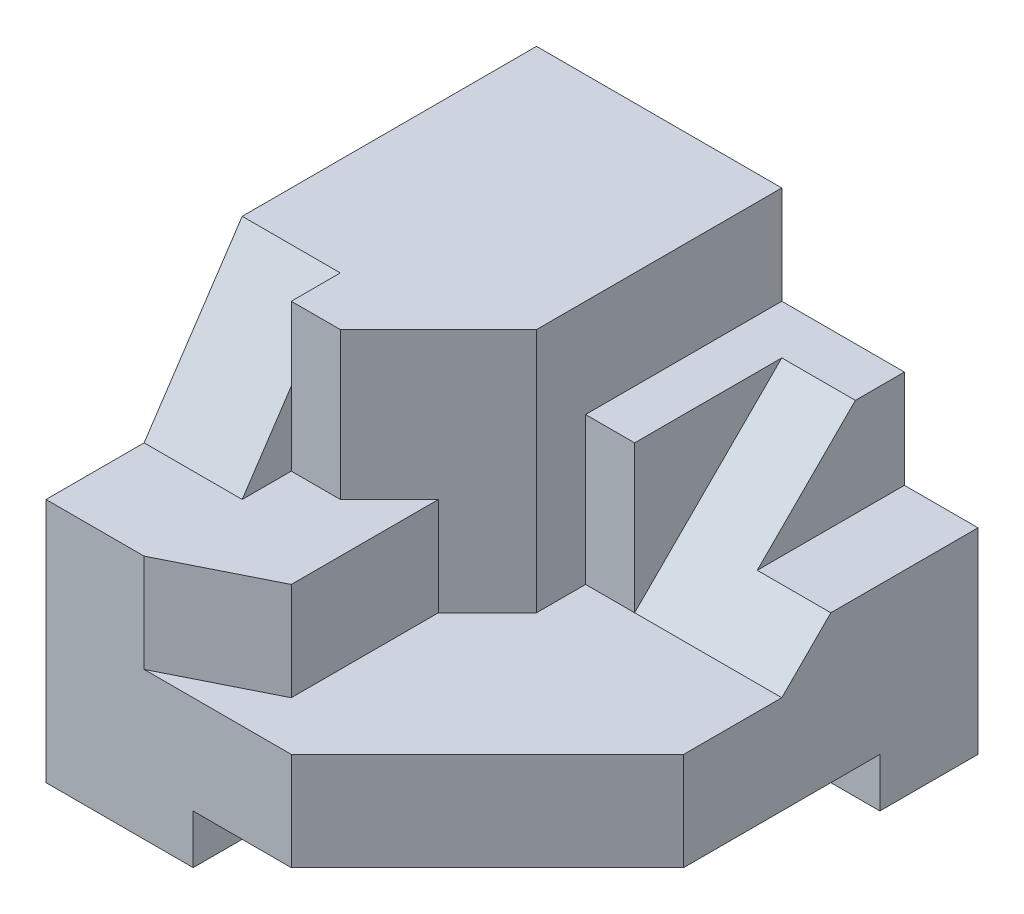
ISO-10303-21;
HEADER;
FILE_DESCRIPTION(('STEP AP214'),'2;1');
FILE_NAME('part.step','',(''),(''),'','','');
FILE_SCHEMA(('AUTOMOTIVE_DESIGN { 1 0 10303 214 1 1 1 1 }'));
ENDSEC;
DATA;
#1=APPLICATION_CONTEXT('core data for automotive mechanical design processes');
#2=APPLICATION_PROTOCOL_DEFINITION('international standard','automotive_design',2000,#1);
#3=PRODUCT_CONTEXT('',#1,'mechanical');
#4=PRODUCT('Part','Part','',(#3));
#5=PRODUCT_RELATED_PRODUCT_CATEGORY('part','',(#4));
#6=PRODUCT_DEFINITION_FORMATION('','',#4);
#7=PRODUCT_DEFINITION_CONTEXT('part definition',#1,'design');
#8=PRODUCT_DEFINITION('design','',#6,#7);
#9=PRODUCT_DEFINITION_SHAPE('','',#8);
#10=(LENGTH_UNIT() NAMED_UNIT(*) SI_UNIT(.MILLI.,.METRE.));
#11=(NAMED_UNIT(*) PLANE_ANGLE_UNIT() SI_UNIT($,.RADIAN.));
#12=(NAMED_UNIT(*) SI_UNIT($,.STERADIAN.) SOLID_ANGLE_UNIT());
#13=UNCERTAINTY_MEASURE_WITH_UNIT(LENGTH_MEASURE(1.E-05),#10,'distance_accuracy_value','');
#14=(GEOMETRIC_REPRESENTATION_CONTEXT(3) GLOBAL_UNCERTAINTY_ASSIGNED_CONTEXT((#13)) GLOBAL_UNIT_ASSIGNED_CONTEXT((#10,
#11,#12)) REPRESENTATION_CONTEXT('',''));
#15=CARTESIAN_POINT('',(0.,0.,0.));
#16=DIRECTION('',(0.,0.,1.));
#17=DIRECTION('',(1.,0.,0.));
#18=AXIS2_PLACEMENT_3D('',#15,#16,#17);
#19=CARTESIAN_POINT('',(-0.500000000000002,-0.999999999999998,9.));
#20=DIRECTION('',(-0.447213595499958,0.,-0.894427190999916));
#21=DIRECTION('',(-0.894427190999916,0.,0.447213595499958));
#22=AXIS2_PLACEMENT_3D('',#19,#20,#21);
#23=PLANE('',#22);
#24=DIRECTION('',(0.894427190999916,0.,-0.447213595499958));
#25=VECTOR('',#24,1.);
#26=CARTESIAN_POINT('',(-2.5,1.,10.));
#27=LINE('',#26,#25);
#28=CARTESIAN_POINT('',(-2.5,1.,10.));
#29=VERTEX_POINT('',#28);
#30=CARTESIAN_POINT('',(-0.500000000000002,1.,9.));
#31=VERTEX_POINT('',#30);
#32=EDGE_CURVE('E209',#29,#31,#27,.T.);
#33=ORIENTED_EDGE('',*,*,#32,.F.);
#34=DIRECTION('',(0.,1.,0.));
#35=VECTOR('',#34,1.);
#36=CARTESIAN_POINT('',(-2.5,-0.999999999999998,10.));
#37=LINE('',#36,#35);
#38=CARTESIAN_POINT('',(-2.5,-0.999999999999998,10.));
#39=VERTEX_POINT('',#38);
#40=EDGE_CURVE('E273',#39,#29,#37,.T.);
#41=ORIENTED_EDGE('',*,*,#40,.F.);
#42=DIRECTION('',(-0.894427190999916,0.,0.447213595499958));
#43=VECTOR('',#42,1.);
#44=CARTESIAN_POINT('',(-0.500000000000002,-0.999999999999998,9.));
#45=LINE('',#44,#43);
#46=CARTESIAN_POINT('',(-0.500000000000002,-0.999999999999998,9.));
#47=VERTEX_POINT('',#46);
#48=EDGE_CURVE('E262',#47,#39,#45,.T.);
#49=ORIENTED_EDGE('',*,*,#48,.F.);
#50=DIRECTION('',(0.,1.,0.));
#51=VECTOR('',#50,1.);
#52=CARTESIAN_POINT('',(-0.500000000000002,-0.999999999999998,9.));
#53=LINE('',#52,#51);
#54=EDGE_CURVE('E277',#47,#31,#53,.T.);
#55=ORIENTED_EDGE('',*,*,#54,.T.);
#56=EDGE_LOOP('',(#33,#41,#49,#55));
#57=FACE_BOUND('',#56,.T.);
#58=ADVANCED_FACE('F33',(#57),#23,.F.);
#59=CARTESIAN_POINT('',(-0.500000000000002,-0.999999999999998,9.));
#60=DIRECTION('',(-1.,0.,0.));
#61=DIRECTION('',(0.,0.,1.));
#62=AXIS2_PLACEMENT_3D('',#59,#60,#61);
#63=PLANE('',#62);
#64=DIRECTION('',(0.,0.,-1.));
#65=VECTOR('',#64,1.);
#66=CARTESIAN_POINT('',(-0.500000000000002,1.,9.));
#67=LINE('',#66,#65);
#68=CARTESIAN_POINT('',(-0.500000000000001,1.,6.));
#69=VERTEX_POINT('',#68);
#70=EDGE_CURVE('E196',#31,#69,#67,.T.);
#71=ORIENTED_EDGE('',*,*,#70,.F.);
#72=ORIENTED_EDGE('',*,*,#54,.F.);
#73=DIRECTION('',(0.,0.,1.));
#74=VECTOR('',#73,1.);
#75=CARTESIAN_POINT('',(-0.500000000000002,-0.999999999999998,9.));
#76=LINE('',#75,#74);
#77=CARTESIAN_POINT('',(-0.500000000000002,-0.999999999999998,6.));
#78=VERTEX_POINT('',#77);
#79=EDGE_CURVE('E259',#78,#47,#76,.T.);
#80=ORIENTED_EDGE('',*,*,#79,.F.);
#81=DIRECTION('',(0.,1.,0.));
#82=VECTOR('',#81,1.);
#83=CARTESIAN_POINT('',(-0.500000000000002,-0.999999999999998,6.));
#84=LINE('',#83,#82);
#85=EDGE_CURVE('E280',#78,#69,#84,.T.);
#86=ORIENTED_EDGE('',*,*,#85,.T.);
#87=EDGE_LOOP('',(#71,#72,#80,#86));
#88=FACE_BOUND('',#87,.T.);
#89=ADVANCED_FACE('F437',(#88),#63,.F.);
#90=CARTESIAN_POINT('',(4.5,-4.,10.));
#91=DIRECTION('',(-1.,0.,0.));
#92=DIRECTION('',(0.,0.,1.));
#93=AXIS2_PLACEMENT_3D('',#90,#91,#92);
#94=PLANE('',#93);
#95=DIRECTION('',(0.,0.707106781186547,-0.707106781186548));
#96=VECTOR('',#95,1.);
#97=CARTESIAN_POINT('',(4.5,0.,3.));
#98=LINE('',#97,#96);
#99=CARTESIAN_POINT('',(4.5,-0.999999999999998,4.));
#100=VERTEX_POINT('',#99);
#101=CARTESIAN_POINT('',(4.5,0.,3.));
#102=VERTEX_POINT('',#101);
#103=EDGE_CURVE('E324',#100,#102,#98,.T.);
#104=ORIENTED_EDGE('',*,*,#103,.F.);
#105=DIRECTION('',(0.,0.,-1.));
#106=VECTOR('',#105,1.);
#107=CARTESIAN_POINT('',(4.5,-0.999999999999998,4.));
#108=LINE('',#107,#106);
#109=CARTESIAN_POINT('',(4.5,-0.999999999999998,6.));
#110=VERTEX_POINT('',#109);
#111=EDGE_CURVE('E267',#110,#100,#108,.T.);
#112=ORIENTED_EDGE('',*,*,#111,.F.);
#113=DIRECTION('',(0.,-1.,0.));
#114=VECTOR('',#113,1.);
#115=CARTESIAN_POINT('',(4.5,4.,6.));
#116=LINE('',#115,#114);
#117=CARTESIAN_POINT('',(4.5,-3.,6.));
#118=VERTEX_POINT('',#117);
#119=EDGE_CURVE('E287',#110,#118,#116,.T.);
#120=ORIENTED_EDGE('',*,*,#119,.T.);
#121=DIRECTION('',(0.,0.,1.));
#122=VECTOR('',#121,1.);
#123=CARTESIAN_POINT('',(4.5,-3.,10.));
#124=LINE('',#123,#122);
#125=CARTESIAN_POINT('',(4.5,-3.,2.));
#126=VERTEX_POINT('',#125);
#127=EDGE_CURVE('E291',#126,#118,#124,.T.);
#128=ORIENTED_EDGE('',*,*,#127,.F.);
#129=DIRECTION('',(0.,-1.,0.));
#130=VECTOR('',#129,1.);
#131=CARTESIAN_POINT('',(4.5,-3.,2.));
#132=LINE('',#131,#130);
#133=CARTESIAN_POINT('',(4.5,-4.,2.));
#134=VERTEX_POINT('',#133);
#135=EDGE_CURVE('E307',#126,#134,#132,.T.);
#136=ORIENTED_EDGE('',*,*,#135,.T.);
#137=DIRECTION('',(0.,0.,-1.));
#138=VECTOR('',#137,1.);
#139=CARTESIAN_POINT('',(4.5,-4.,10.));
#140=LINE('',#139,#138);
#141=CARTESIAN_POINT('',(4.5,-4.,0.));
#142=VERTEX_POINT('',#141);
#143=EDGE_CURVE('E363',#134,#142,#140,.T.);
#144=ORIENTED_EDGE('',*,*,#143,.T.);
#145=DIRECTION('',(0.,1.,0.));
#146=VECTOR('',#145,1.);
#147=CARTESIAN_POINT('',(4.5,-4.,0.));
#148=LINE('',#147,#146);
#149=CARTESIAN_POINT('',(4.5,0.,0.));
#150=VERTEX_POINT('',#149);
#151=EDGE_CURVE('E357',#142,#150,#148,.T.);
#152=ORIENTED_EDGE('',*,*,#151,.T.);
#153=DIRECTION('',(0.,0.,-1.));
#154=VECTOR('',#153,1.);
#155=CARTESIAN_POINT('',(4.5,0.,0.));
#156=LINE('',#155,#154);
#157=EDGE_CURVE('E330',#102,#150,#156,.T.);
#158=ORIENTED_EDGE('',*,*,#157,.F.);
#159=EDGE_LOOP('',(#104,#112,#120,#128,#136,#144,#152,#158));
#160=FACE_BOUND('',#159,.T.);
#161=ADVANCED_FACE('F404',(#160),#94,.F.);
#162=CARTESIAN_POINT('',(4.5,4.,10.));
#163=DIRECTION('',(0.,-1.,0.));
#164=DIRECTION('',(0.,0.,-1.));
#165=AXIS2_PLACEMENT_3D('',#162,#163,#164);
#166=PLANE('',#165);
#167=DIRECTION('',(0.,0.,-1.));
#168=VECTOR('',#167,1.);
#169=CARTESIAN_POINT('',(-2.5,4.,10.));
#170=LINE('',#169,#168);
#171=CARTESIAN_POINT('',(-2.5,4.,7.));
#172=VERTEX_POINT('',#171);
#173=CARTESIAN_POINT('',(-2.5,4.,6.));
#174=VERTEX_POINT('',#173);
#175=EDGE_CURVE('E223',#172,#174,#170,.T.);
#176=ORIENTED_EDGE('',*,*,#175,.F.);
#177=DIRECTION('',(-1.,0.,0.));
#178=VECTOR('',#177,1.);
#179=CARTESIAN_POINT('',(-1.5,4.,7.));
#180=LINE('',#179,#178);
#181=CARTESIAN_POINT('',(-1.5,4.,7.));
#182=VERTEX_POINT('',#181);
#183=EDGE_CURVE('E199',#182,#172,#180,.T.);
#184=ORIENTED_EDGE('',*,*,#183,.F.);
#185=DIRECTION('',(-0.707106781186549,0.,0.707106781186547));
#186=VECTOR('',#185,1.);
#187=CARTESIAN_POINT('',(-0.500000000000002,4.,6.));
#188=LINE('',#187,#186);
#189=CARTESIAN_POINT('',(0.5,4.,5.));
#190=VERTEX_POINT('',#189);
#191=EDGE_CURVE('E205',#190,#182,#188,.T.);
#192=ORIENTED_EDGE('',*,*,#191,.F.);
#193=DIRECTION('',(0.,0.,1.));
#194=VECTOR('',#193,1.);
#195=CARTESIAN_POINT('',(0.5,4.,5.));
#196=LINE('',#195,#194);
#197=CARTESIAN_POINT('',(0.5,4.,0.));
#198=VERTEX_POINT('',#197);
#199=EDGE_CURVE('E250',#198,#190,#196,.T.);
#200=ORIENTED_EDGE('',*,*,#199,.F.);
#201=DIRECTION('',(-1.,0.,0.));
#202=VECTOR('',#201,1.);
#203=CARTESIAN_POINT('',(4.5,4.,0.));
#204=LINE('',#203,#202);
#205=CARTESIAN_POINT('',(-4.5,4.,0.));
#206=VERTEX_POINT('',#205);
#207=EDGE_CURVE('E348',#198,#206,#204,.T.);
#208=ORIENTED_EDGE('',*,*,#207,.T.);
#209=DIRECTION('',(0.,0.,-1.));
#210=VECTOR('',#209,1.);
#211=CARTESIAN_POINT('',(-4.5,4.,10.));
#212=LINE('',#211,#210);
#213=CARTESIAN_POINT('',(-4.5,4.,6.));
#214=VERTEX_POINT('',#213);
#215=EDGE_CURVE('E351',#214,#206,#212,.T.);
#216=ORIENTED_EDGE('',*,*,#215,.F.);
#217=DIRECTION('',(-1.,0.,0.));
#218=VECTOR('',#217,1.);
#219=CARTESIAN_POINT('',(-2.5,4.,6.));
#220=LINE('',#219,#218);
#221=EDGE_CURVE('E230',#174,#214,#220,.T.);
#222=ORIENTED_EDGE('',*,*,#221,.F.);
#223=EDGE_LOOP('',(#176,#184,#192,#200,#208,#216,#222));
#224=FACE_BOUND('',#223,.T.);
#225=ADVANCED_FACE('F421',(#224),#166,.F.);
#226=CARTESIAN_POINT('',(0.,0.,10.));
#227=DIRECTION('',(0.,0.,1.));
#228=DIRECTION('',(1.,0.,0.));
#229=AXIS2_PLACEMENT_3D('',#226,#227,#228);
#230=PLANE('',#229);
#231=DIRECTION('',(-1.,0.,0.));
#232=VECTOR('',#231,1.);
#233=CARTESIAN_POINT('',(-2.5,1.,10.));
#234=LINE('',#233,#232);
#235=CARTESIAN_POINT('',(-4.5,1.,10.));
#236=VERTEX_POINT('',#235);
#237=EDGE_CURVE('E234',#29,#236,#234,.T.);
#238=ORIENTED_EDGE('',*,*,#237,.T.);
#239=DIRECTION('',(0.,-1.,0.));
#240=VECTOR('',#239,1.);
#241=CARTESIAN_POINT('',(-4.5,-4.,10.));
#242=LINE('',#241,#240);
#243=CARTESIAN_POINT('',(-4.5,-4.,10.));
#244=VERTEX_POINT('',#243);
#245=EDGE_CURVE('E345',#236,#244,#242,.T.);
#246=ORIENTED_EDGE('',*,*,#245,.T.);
#247=DIRECTION('',(1.,0.,0.));
#248=VECTOR('',#247,1.);
#249=CARTESIAN_POINT('',(4.5,-4.,10.));
#250=LINE('',#249,#248);
#251=CARTESIAN_POINT('',(-1.5,-4.,10.));
#252=VERTEX_POINT('',#251);
#253=EDGE_CURVE('E347',#244,#252,#250,.T.);
#254=ORIENTED_EDGE('',*,*,#253,.T.);
#255=DIRECTION('',(0.,-1.,0.));
#256=VECTOR('',#255,1.);
#257=CARTESIAN_POINT('',(-1.5,-3.,10.));
#258=LINE('',#257,#256);
#259=CARTESIAN_POINT('',(-1.5,-3.,10.));
#260=VERTEX_POINT('',#259);
#261=EDGE_CURVE('E303',#260,#252,#258,.T.);
#262=ORIENTED_EDGE('',*,*,#261,.F.);
#263=DIRECTION('',(-1.,0.,0.));
#264=VECTOR('',#263,1.);
#265=CARTESIAN_POINT('',(-1.5,-3.,10.));
#266=LINE('',#265,#264);
#267=CARTESIAN_POINT('',(0.499999999999998,-3.,10.));
#268=VERTEX_POINT('',#267);
#269=EDGE_CURVE('E294',#268,#260,#266,.T.);
#270=ORIENTED_EDGE('',*,*,#269,.F.);
#271=DIRECTION('',(0.,-1.,0.));
#272=VECTOR('',#271,1.);
#273=CARTESIAN_POINT('',(0.499999999999998,4.,10.));
#274=LINE('',#273,#272);
#275=CARTESIAN_POINT('',(0.499999999999999,-0.999999999999998,10.));
#276=VERTEX_POINT('',#275);
#277=EDGE_CURVE('E55',#276,#268,#274,.T.);
#278=ORIENTED_EDGE('',*,*,#277,.F.);
#279=DIRECTION('',(1.,0.,0.));
#280=VECTOR('',#279,1.);
#281=CARTESIAN_POINT('',(-2.5,-0.999999999999998,10.));
#282=LINE('',#281,#280);
#283=EDGE_CURVE('E48',#39,#276,#282,.T.);
#284=ORIENTED_EDGE('',*,*,#283,.F.);
#285=ORIENTED_EDGE('',*,*,#40,.T.);
#286=EDGE_LOOP('',(#238,#246,#254,#262,#270,#278,#284,#285));
#287=FACE_BOUND('',#286,.T.);
#288=ADVANCED_FACE('F456',(#287),#230,.T.);
#289=CARTESIAN_POINT('',(0.,-3.,0.));
#290=DIRECTION('',(0.,1.,0.));
#291=DIRECTION('',(-1.,0.,0.));
#292=AXIS2_PLACEMENT_3D('',#289,#290,#291);
#293=PLANE('',#292);
#294=DIRECTION('',(-0.707106781186547,0.,0.707106781186548));
#295=VECTOR('',#294,1.);
#296=CARTESIAN_POINT('',(5.25,-3.,5.25));
#297=LINE('',#296,#295);
#298=EDGE_CURVE('E276',#118,#268,#297,.T.);
#299=ORIENTED_EDGE('',*,*,#298,.T.);
#300=ORIENTED_EDGE('',*,*,#269,.T.);
#301=DIRECTION('',(0.,0.,-1.));
#302=VECTOR('',#301,1.);
#303=CARTESIAN_POINT('',(-1.5,-3.,2.));
#304=LINE('',#303,#302);
#305=CARTESIAN_POINT('',(-1.5,-3.,2.));
#306=VERTEX_POINT('',#305);
#307=EDGE_CURVE('E297',#260,#306,#304,.T.);
#308=ORIENTED_EDGE('',*,*,#307,.T.);
#309=DIRECTION('',(1.,0.,0.));
#310=VECTOR('',#309,1.);
#311=CARTESIAN_POINT('',(4.5,-3.,2.));
#312=LINE('',#311,#310);
#313=EDGE_CURVE('E300',#306,#126,#312,.T.);
#314=ORIENTED_EDGE('',*,*,#313,.T.);
#315=ORIENTED_EDGE('',*,*,#127,.T.);
#316=EDGE_LOOP('',(#299,#300,#308,#314,#315));
#317=FACE_BOUND('',#316,.T.);
#318=ADVANCED_FACE('F453',(#317),#293,.F.);
#319=CARTESIAN_POINT('',(-4.5,-4.,10.));
#320=DIRECTION('',(1.,0.,0.));
#321=DIRECTION('',(0.,0.,-1.));
#322=AXIS2_PLACEMENT_3D('',#319,#320,#321);
#323=PLANE('',#322);
#324=ORIENTED_EDGE('',*,*,#245,.F.);
#325=DIRECTION('',(0.,0.,1.));
#326=VECTOR('',#325,1.);
#327=CARTESIAN_POINT('',(-4.5,1.,8.));
#328=LINE('',#327,#326);
#329=CARTESIAN_POINT('',(-4.5,1.,8.));
#330=VERTEX_POINT('',#329);
#331=EDGE_CURVE('E226',#330,#236,#328,.T.);
#332=ORIENTED_EDGE('',*,*,#331,.F.);
#333=DIRECTION('',(0.,-0.832050294337844,0.554700196225229));
#334=VECTOR('',#333,1.);
#335=CARTESIAN_POINT('',(-4.5,4.,6.));
#336=LINE('',#335,#334);
#337=EDGE_CURVE('E222',#214,#330,#336,.T.);
#338=ORIENTED_EDGE('',*,*,#337,.F.);
#339=ORIENTED_EDGE('',*,*,#215,.T.);
#340=DIRECTION('',(0.,-1.,0.));
#341=VECTOR('',#340,1.);
#342=CARTESIAN_POINT('',(-4.5,-4.,0.));
#343=LINE('',#342,#341);
#344=CARTESIAN_POINT('',(-4.5,-4.,0.));
#345=VERTEX_POINT('',#344);
#346=EDGE_CURVE('E340',#206,#345,#343,.T.);
#347=ORIENTED_EDGE('',*,*,#346,.T.);
#348=DIRECTION('',(0.,0.,-1.));
#349=VECTOR('',#348,1.);
#350=CARTESIAN_POINT('',(-4.5,-4.,10.));
#351=LINE('',#350,#349);
#352=EDGE_CURVE('E365',#244,#345,#351,.T.);
#353=ORIENTED_EDGE('',*,*,#352,.F.);
#354=EDGE_LOOP('',(#324,#332,#338,#339,#347,#353));
#355=FACE_BOUND('',#354,.T.);
#356=ADVANCED_FACE('F35',(#355),#323,.F.);
#357=CARTESIAN_POINT('',(4.5,-4.,10.));
#358=DIRECTION('',(0.,1.,0.));
#359=DIRECTION('',(-1.,0.,0.));
#360=AXIS2_PLACEMENT_3D('',#357,#358,#359);
#361=PLANE('',#360);
#362=ORIENTED_EDGE('',*,*,#143,.F.);
#363=DIRECTION('',(1.,0.,0.));
#364=VECTOR('',#363,1.);
#365=CARTESIAN_POINT('',(4.5,-4.,2.));
#366=LINE('',#365,#364);
#367=CARTESIAN_POINT('',(-1.5,-4.,2.));
#368=VERTEX_POINT('',#367);
#369=EDGE_CURVE('E295',#368,#134,#366,.T.);
#370=ORIENTED_EDGE('',*,*,#369,.F.);
#371=DIRECTION('',(0.,0.,-1.));
#372=VECTOR('',#371,1.);
#373=CARTESIAN_POINT('',(-1.5,-4.,2.));
#374=LINE('',#373,#372);
#375=EDGE_CURVE('E289',#252,#368,#374,.T.);
#376=ORIENTED_EDGE('',*,*,#375,.F.);
#377=ORIENTED_EDGE('',*,*,#253,.F.);
#378=ORIENTED_EDGE('',*,*,#352,.T.);
#379=DIRECTION('',(1.,0.,0.));
#380=VECTOR('',#379,1.);
#381=CARTESIAN_POINT('',(4.5,-4.,0.));
#382=LINE('',#381,#380);
#383=EDGE_CURVE('E354',#345,#142,#382,.T.);
#384=ORIENTED_EDGE('',*,*,#383,.T.);
#385=EDGE_LOOP('',(#362,#370,#376,#377,#378,#384));
#386=FACE_BOUND('',#385,.T.);
#387=ADVANCED_FACE('F411',(#386),#361,.F.);
#388=CARTESIAN_POINT('',(0.,0.,0.));
#389=DIRECTION('',(0.,0.,1.));
#390=DIRECTION('',(1.,0.,0.));
#391=AXIS2_PLACEMENT_3D('',#388,#389,#390);
#392=PLANE('',#391);
#393=DIRECTION('',(0.,1.,0.));
#394=VECTOR('',#393,1.);
#395=CARTESIAN_POINT('',(0.5,4.,0.));
#396=LINE('',#395,#394);
#397=CARTESIAN_POINT('',(0.5,2.,0.));
#398=VERTEX_POINT('',#397);
#399=EDGE_CURVE('E244',#398,#198,#396,.T.);
#400=ORIENTED_EDGE('',*,*,#399,.F.);
#401=DIRECTION('',(1.,0.,0.));
#402=VECTOR('',#401,1.);
#403=CARTESIAN_POINT('',(1.5,2.,0.));
#404=LINE('',#403,#402);
#405=CARTESIAN_POINT('',(3.,2.,0.));
#406=VERTEX_POINT('',#405);
#407=EDGE_CURVE('E321',#398,#406,#404,.T.);
#408=ORIENTED_EDGE('',*,*,#407,.T.);
#409=DIRECTION('',(0.,1.,0.));
#410=VECTOR('',#409,1.);
#411=CARTESIAN_POINT('',(3.,4.,0.));
#412=LINE('',#411,#410);
#413=CARTESIAN_POINT('',(3.,0.,0.));
#414=VERTEX_POINT('',#413);
#415=EDGE_CURVE('E329',#414,#406,#412,.T.);
#416=ORIENTED_EDGE('',*,*,#415,.F.);
#417=DIRECTION('',(1.,0.,0.));
#418=VECTOR('',#417,1.);
#419=CARTESIAN_POINT('',(3.,0.,0.));
#420=LINE('',#419,#418);
#421=EDGE_CURVE('E337',#414,#150,#420,.T.);
#422=ORIENTED_EDGE('',*,*,#421,.T.);
#423=ORIENTED_EDGE('',*,*,#151,.F.);
#424=ORIENTED_EDGE('',*,*,#383,.F.);
#425=ORIENTED_EDGE('',*,*,#346,.F.);
#426=ORIENTED_EDGE('',*,*,#207,.F.);
#427=EDGE_LOOP('',(#400,#408,#416,#422,#423,#424,#425,#426));
#428=FACE_BOUND('',#427,.T.);
#429=ADVANCED_FACE('F384',(#428),#392,.F.);
#430=CARTESIAN_POINT('',(3.,0.,0.));
#431=DIRECTION('',(0.,-1.,0.));
#432=DIRECTION('',(0.,0.,-1.));
#433=AXIS2_PLACEMENT_3D('',#430,#431,#432);
#434=PLANE('',#433);
#435=ORIENTED_EDGE('',*,*,#157,.T.);
#436=ORIENTED_EDGE('',*,*,#421,.F.);
#437=DIRECTION('',(0.,0.,-1.));
#438=VECTOR('',#437,1.);
#439=CARTESIAN_POINT('',(3.,0.,0.));
#440=LINE('',#439,#438);
#441=CARTESIAN_POINT('',(3.,0.,3.));
#442=VERTEX_POINT('',#441);
#443=EDGE_CURVE('E327',#442,#414,#440,.T.);
#444=ORIENTED_EDGE('',*,*,#443,.F.);
#445=DIRECTION('',(1.,0.,0.));
#446=VECTOR('',#445,1.);
#447=CARTESIAN_POINT('',(3.,0.,3.));
#448=LINE('',#447,#446);
#449=EDGE_CURVE('E341',#442,#102,#448,.T.);
#450=ORIENTED_EDGE('',*,*,#449,.T.);
#451=EDGE_LOOP('',(#435,#436,#444,#450));
#452=FACE_BOUND('',#451,.T.);
#453=ADVANCED_FACE('F379',(#452),#434,.F.);
#454=CARTESIAN_POINT('',(3.,0.,3.));
#455=DIRECTION('',(0.,-0.707106781186548,-0.707106781186547));
#456=DIRECTION('',(0.,0.707106781186547,-0.707106781186548));
#457=AXIS2_PLACEMENT_3D('',#454,#455,#456);
#458=PLANE('',#457);
#459=ORIENTED_EDGE('',*,*,#103,.T.);
#460=ORIENTED_EDGE('',*,*,#449,.F.);
#461=DIRECTION('',(0.,-0.707106781186548,0.707106781186547));
#462=VECTOR('',#461,1.);
#463=CARTESIAN_POINT('',(3.,1.5,1.5));
#464=LINE('',#463,#462);
#465=CARTESIAN_POINT('',(3.,2.,1.));
#466=VERTEX_POINT('',#465);
#467=EDGE_CURVE('E41',#466,#442,#464,.T.);
#468=ORIENTED_EDGE('',*,*,#467,.F.);
#469=DIRECTION('',(1.,0.,0.));
#470=VECTOR('',#469,1.);
#471=CARTESIAN_POINT('',(1.5,2.,1.));
#472=LINE('',#471,#470);
#473=CARTESIAN_POINT('',(1.5,2.,1.));
#474=VERTEX_POINT('',#473);
#475=EDGE_CURVE('E319',#474,#466,#472,.T.);
#476=ORIENTED_EDGE('',*,*,#475,.F.);
#477=DIRECTION('',(0.,0.707106781186548,-0.707106781186547));
#478=VECTOR('',#477,1.);
#479=CARTESIAN_POINT('',(1.5,2.,1.));
#480=LINE('',#479,#478);
#481=CARTESIAN_POINT('',(1.5,-0.999999999999998,4.));
#482=VERTEX_POINT('',#481);
#483=EDGE_CURVE('E316',#482,#474,#480,.T.);
#484=ORIENTED_EDGE('',*,*,#483,.F.);
#485=DIRECTION('',(1.,0.,0.));
#486=VECTOR('',#485,1.);
#487=CARTESIAN_POINT('',(3.,-0.999999999999998,4.));
#488=LINE('',#487,#486);
#489=EDGE_CURVE('E333',#482,#100,#488,.T.);
#490=ORIENTED_EDGE('',*,*,#489,.T.);
#491=EDGE_LOOP('',(#459,#460,#468,#476,#484,#490));
#492=FACE_BOUND('',#491,.T.);
#493=ADVANCED_FACE('F375',(#492),#458,.F.);
#494=CARTESIAN_POINT('',(3.,0.,0.));
#495=DIRECTION('',(-1.,0.,0.));
#496=DIRECTION('',(0.,0.,1.));
#497=AXIS2_PLACEMENT_3D('',#494,#495,#496);
#498=PLANE('',#497);
#499=ORIENTED_EDGE('',*,*,#415,.T.);
#500=DIRECTION('',(0.,0.,-1.));
#501=VECTOR('',#500,1.);
#502=CARTESIAN_POINT('',(3.,2.,0.));
#503=LINE('',#502,#501);
#504=EDGE_CURVE('E310',#466,#406,#503,.T.);
#505=ORIENTED_EDGE('',*,*,#504,.F.);
#506=ORIENTED_EDGE('',*,*,#467,.T.);
#507=ORIENTED_EDGE('',*,*,#443,.T.);
#508=EDGE_LOOP('',(#499,#505,#506,#507));
#509=FACE_BOUND('',#508,.T.);
#510=ADVANCED_FACE('F370',(#509),#498,.F.);
#511=CARTESIAN_POINT('',(1.5,2.,0.));
#512=DIRECTION('',(0.,-1.,0.));
#513=DIRECTION('',(0.,0.,-1.));
#514=AXIS2_PLACEMENT_3D('',#511,#512,#513);
#515=PLANE('',#514);
#516=ORIENTED_EDGE('',*,*,#504,.T.);
#517=ORIENTED_EDGE('',*,*,#407,.F.);
#518=DIRECTION('',(0.,0.,-1.));
#519=VECTOR('',#518,1.);
#520=CARTESIAN_POINT('',(0.5,2.,0.));
#521=LINE('',#520,#519);
#522=CARTESIAN_POINT('',(0.5,2.,4.));
#523=VERTEX_POINT('',#522);
#524=EDGE_CURVE('E241',#523,#398,#521,.T.);
#525=ORIENTED_EDGE('',*,*,#524,.F.);
#526=DIRECTION('',(1.,0.,0.));
#527=VECTOR('',#526,1.);
#528=CARTESIAN_POINT('',(0.5,2.,4.));
#529=LINE('',#528,#527);
#530=CARTESIAN_POINT('',(1.5,2.,4.));
#531=VERTEX_POINT('',#530);
#532=EDGE_CURVE('E247',#523,#531,#529,.T.);
#533=ORIENTED_EDGE('',*,*,#532,.T.);
#534=DIRECTION('',(0.,0.,-1.));
#535=VECTOR('',#534,1.);
#536=CARTESIAN_POINT('',(1.5,2.,1.));
#537=LINE('',#536,#535);
#538=EDGE_CURVE('E237',#531,#474,#537,.T.);
#539=ORIENTED_EDGE('',*,*,#538,.T.);
#540=ORIENTED_EDGE('',*,*,#475,.T.);
#541=EDGE_LOOP('',(#516,#517,#525,#533,#539,#540));
#542=FACE_BOUND('',#541,.T.);
#543=ADVANCED_FACE('F387',(#542),#515,.F.);
#544=CARTESIAN_POINT('',(1.5,0.,0.));
#545=DIRECTION('',(-1.,0.,0.));
#546=DIRECTION('',(0.,0.,1.));
#547=AXIS2_PLACEMENT_3D('',#544,#545,#546);
#548=PLANE('',#547);
#549=ORIENTED_EDGE('',*,*,#483,.T.);
#550=ORIENTED_EDGE('',*,*,#538,.F.);
#551=DIRECTION('',(0.,-1.,0.));
#552=VECTOR('',#551,1.);
#553=CARTESIAN_POINT('',(1.5,-0.999999999999998,4.));
#554=LINE('',#553,#552);
#555=EDGE_CURVE('E314',#531,#482,#554,.T.);
#556=ORIENTED_EDGE('',*,*,#555,.T.);
#557=EDGE_LOOP('',(#549,#550,#556));
#558=FACE_BOUND('',#557,.T.);
#559=ADVANCED_FACE('F400',(#558),#548,.F.);
#560=CARTESIAN_POINT('',(4.5,-3.,2.));
#561=DIRECTION('',(0.,0.,-1.));
#562=DIRECTION('',(-1.,0.,0.));
#563=AXIS2_PLACEMENT_3D('',#560,#561,#562);
#564=PLANE('',#563);
#565=ORIENTED_EDGE('',*,*,#369,.T.);
#566=ORIENTED_EDGE('',*,*,#135,.F.);
#567=ORIENTED_EDGE('',*,*,#313,.F.);
#568=DIRECTION('',(0.,-1.,0.));
#569=VECTOR('',#568,1.);
#570=CARTESIAN_POINT('',(-1.5,-3.,2.));
#571=LINE('',#570,#569);
#572=EDGE_CURVE('E311',#306,#368,#571,.T.);
#573=ORIENTED_EDGE('',*,*,#572,.T.);
#574=EDGE_LOOP('',(#565,#566,#567,#573));
#575=FACE_BOUND('',#574,.T.);
#576=ADVANCED_FACE('F458',(#575),#564,.F.);
#577=CARTESIAN_POINT('',(-1.5,-3.,2.));
#578=DIRECTION('',(-1.,0.,0.));
#579=DIRECTION('',(0.,-1.,0.));
#580=AXIS2_PLACEMENT_3D('',#577,#578,#579);
#581=PLANE('',#580);
#582=ORIENTED_EDGE('',*,*,#375,.T.);
#583=ORIENTED_EDGE('',*,*,#572,.F.);
#584=ORIENTED_EDGE('',*,*,#307,.F.);
#585=ORIENTED_EDGE('',*,*,#261,.T.);
#586=EDGE_LOOP('',(#582,#583,#584,#585));
#587=FACE_BOUND('',#586,.T.);
#588=ADVANCED_FACE('F452',(#587),#581,.F.);
#589=CARTESIAN_POINT('',(5.25,4.,5.25));
#590=DIRECTION('',(0.707106781186548,0.,0.707106781186547));
#591=DIRECTION('',(0.707106781186547,0.,-0.707106781186548));
#592=AXIS2_PLACEMENT_3D('',#589,#590,#591);
#593=PLANE('',#592);
#594=DIRECTION('',(0.707106781186547,0.,-0.707106781186548));
#595=VECTOR('',#594,1.);
#596=CARTESIAN_POINT('',(4.5,-0.999999999999998,6.));
#597=LINE('',#596,#595);
#598=EDGE_CURVE('E265',#276,#110,#597,.T.);
#599=ORIENTED_EDGE('',*,*,#598,.F.);
#600=ORIENTED_EDGE('',*,*,#277,.T.);
#601=ORIENTED_EDGE('',*,*,#298,.F.);
#602=ORIENTED_EDGE('',*,*,#119,.F.);
#603=EDGE_LOOP('',(#599,#600,#601,#602));
#604=FACE_BOUND('',#603,.T.);
#605=ADVANCED_FACE('F449',(#604),#593,.T.);
#606=CARTESIAN_POINT('',(0.5,-0.999999999999998,4.));
#607=DIRECTION('',(0.,0.,-1.));
#608=DIRECTION('',(-1.,0.,0.));
#609=AXIS2_PLACEMENT_3D('',#606,#607,#608);
#610=PLANE('',#609);
#611=ORIENTED_EDGE('',*,*,#555,.F.);
#612=ORIENTED_EDGE('',*,*,#532,.F.);
#613=DIRECTION('',(0.,1.,0.));
#614=VECTOR('',#613,1.);
#615=CARTESIAN_POINT('',(0.5,-0.999999999999998,4.));
#616=LINE('',#615,#614);
#617=CARTESIAN_POINT('',(0.5,-0.999999999999998,4.));
#618=VERTEX_POINT('',#617);
#619=EDGE_CURVE('E269',#618,#523,#616,.T.);
#620=ORIENTED_EDGE('',*,*,#619,.F.);
#621=DIRECTION('',(-1.,0.,0.));
#622=VECTOR('',#621,1.);
#623=CARTESIAN_POINT('',(1.5,-0.999999999999998,4.));
#624=LINE('',#623,#622);
#625=EDGE_CURVE('E251',#482,#618,#624,.T.);
#626=ORIENTED_EDGE('',*,*,#625,.F.);
#627=EDGE_LOOP('',(#611,#612,#620,#626));
#628=FACE_BOUND('',#627,.T.);
#629=ADVANCED_FACE('F396',(#628),#610,.F.);
#630=CARTESIAN_POINT('',(-0.500000000000002,-0.999999999999998,6.));
#631=DIRECTION('',(-0.707106781186547,0.,-0.707106781186549));
#632=DIRECTION('',(-0.707106781186549,0.,0.707106781186547));
#633=AXIS2_PLACEMENT_3D('',#630,#631,#632);
#634=PLANE('',#633);
#635=ORIENTED_EDGE('',*,*,#191,.T.);
#636=DIRECTION('',(0.,1.,0.));
#637=VECTOR('',#636,1.);
#638=CARTESIAN_POINT('',(-1.5,1.,7.));
#639=LINE('',#638,#637);
#640=CARTESIAN_POINT('',(-1.5,1.,7.));
#641=VERTEX_POINT('',#640);
#642=EDGE_CURVE('E202',#641,#182,#639,.T.);
#643=ORIENTED_EDGE('',*,*,#642,.F.);
#644=DIRECTION('',(-0.707106781186548,0.,0.707106781186548));
#645=VECTOR('',#644,1.);
#646=CARTESIAN_POINT('',(0.5,1.,5.));
#647=LINE('',#646,#645);
#648=EDGE_CURVE('E190',#69,#641,#647,.T.);
#649=ORIENTED_EDGE('',*,*,#648,.F.);
#650=ORIENTED_EDGE('',*,*,#85,.F.);
#651=DIRECTION('',(-0.707106781186549,0.,0.707106781186547));
#652=VECTOR('',#651,1.);
#653=CARTESIAN_POINT('',(-0.500000000000002,-0.999999999999998,6.));
#654=LINE('',#653,#652);
#655=CARTESIAN_POINT('',(0.5,-0.999999999999998,5.));
#656=VERTEX_POINT('',#655);
#657=EDGE_CURVE('E256',#656,#78,#654,.T.);
#658=ORIENTED_EDGE('',*,*,#657,.F.);
#659=DIRECTION('',(0.,1.,0.));
#660=VECTOR('',#659,1.);
#661=CARTESIAN_POINT('',(0.5,-0.999999999999998,5.));
#662=LINE('',#661,#660);
#663=EDGE_CURVE('E282',#656,#190,#662,.T.);
#664=ORIENTED_EDGE('',*,*,#663,.T.);
#665=EDGE_LOOP('',(#635,#643,#649,#650,#658,#664));
#666=FACE_BOUND('',#665,.T.);
#667=ADVANCED_FACE('F203',(#666),#634,.F.);
#668=CARTESIAN_POINT('',(0.5,-0.999999999999998,5.));
#669=DIRECTION('',(-1.,0.,0.));
#670=DIRECTION('',(0.,0.,1.));
#671=AXIS2_PLACEMENT_3D('',#668,#669,#670);
#672=PLANE('',#671);
#673=ORIENTED_EDGE('',*,*,#199,.T.);
#674=ORIENTED_EDGE('',*,*,#663,.F.);
#675=DIRECTION('',(0.,0.,1.));
#676=VECTOR('',#675,1.);
#677=CARTESIAN_POINT('',(0.5,-0.999999999999998,5.));
#678=LINE('',#677,#676);
#679=EDGE_CURVE('E253',#618,#656,#678,.T.);
#680=ORIENTED_EDGE('',*,*,#679,.F.);
#681=ORIENTED_EDGE('',*,*,#619,.T.);
#682=ORIENTED_EDGE('',*,*,#524,.T.);
#683=ORIENTED_EDGE('',*,*,#399,.T.);
#684=EDGE_LOOP('',(#673,#674,#680,#681,#682,#683));
#685=FACE_BOUND('',#684,.T.);
#686=ADVANCED_FACE('F390',(#685),#672,.F.);
#687=CARTESIAN_POINT('',(0.,-0.999999999999998,0.));
#688=DIRECTION('',(0.,-1.,0.));
#689=DIRECTION('',(0.,0.,-1.));
#690=AXIS2_PLACEMENT_3D('',#687,#688,#689);
#691=PLANE('',#690);
#692=ORIENTED_EDGE('',*,*,#489,.F.);
#693=ORIENTED_EDGE('',*,*,#625,.T.);
#694=ORIENTED_EDGE('',*,*,#679,.T.);
#695=ORIENTED_EDGE('',*,*,#657,.T.);
#696=ORIENTED_EDGE('',*,*,#79,.T.);
#697=ORIENTED_EDGE('',*,*,#48,.T.);
#698=ORIENTED_EDGE('',*,*,#283,.T.);
#699=ORIENTED_EDGE('',*,*,#598,.T.);
#700=ORIENTED_EDGE('',*,*,#111,.T.);
#701=EDGE_LOOP('',(#692,#693,#694,#695,#696,#697,#698,#699,#700));
#702=FACE_BOUND('',#701,.T.);
#703=ADVANCED_FACE('F424',(#702),#691,.F.);
#704=CARTESIAN_POINT('',(-2.5,1.,8.));
#705=DIRECTION('',(0.,-1.,0.));
#706=DIRECTION('',(0.,0.,-1.));
#707=AXIS2_PLACEMENT_3D('',#704,#705,#706);
#708=PLANE('',#707);
#709=ORIENTED_EDGE('',*,*,#331,.T.);
#710=ORIENTED_EDGE('',*,*,#237,.F.);
#711=ORIENTED_EDGE('',*,*,#32,.T.);
#712=ORIENTED_EDGE('',*,*,#70,.T.);
#713=ORIENTED_EDGE('',*,*,#648,.T.);
#714=DIRECTION('',(-1.,0.,0.));
#715=VECTOR('',#714,1.);
#716=CARTESIAN_POINT('',(-1.5,1.,7.));
#717=LINE('',#716,#715);
#718=CARTESIAN_POINT('',(-2.5,1.,7.));
#719=VERTEX_POINT('',#718);
#720=EDGE_CURVE('E194',#641,#719,#717,.T.);
#721=ORIENTED_EDGE('',*,*,#720,.T.);
#722=DIRECTION('',(0.,0.,1.));
#723=VECTOR('',#722,1.);
#724=CARTESIAN_POINT('',(-2.5,1.,7.));
#725=LINE('',#724,#723);
#726=CARTESIAN_POINT('',(-2.5,1.,8.));
#727=VERTEX_POINT('',#726);
#728=EDGE_CURVE('E214',#719,#727,#725,.T.);
#729=ORIENTED_EDGE('',*,*,#728,.T.);
#730=DIRECTION('',(-1.,0.,0.));
#731=VECTOR('',#730,1.);
#732=CARTESIAN_POINT('',(-2.5,1.,8.));
#733=LINE('',#732,#731);
#734=EDGE_CURVE('E238',#727,#330,#733,.T.);
#735=ORIENTED_EDGE('',*,*,#734,.T.);
#736=EDGE_LOOP('',(#709,#710,#711,#712,#713,#721,#729,#735));
#737=FACE_BOUND('',#736,.T.);
#738=ADVANCED_FACE('F192',(#737),#708,.F.);
#739=CARTESIAN_POINT('',(-2.5,4.,6.));
#740=DIRECTION('',(0.,-0.554700196225229,-0.832050294337844));
#741=DIRECTION('',(0.,0.832050294337844,-0.554700196225229));
#742=AXIS2_PLACEMENT_3D('',#739,#740,#741);
#743=PLANE('',#742);
#744=ORIENTED_EDGE('',*,*,#337,.T.);
#745=ORIENTED_EDGE('',*,*,#734,.F.);
#746=DIRECTION('',(0.,-0.832050294337844,0.554700196225229));
#747=VECTOR('',#746,1.);
#748=CARTESIAN_POINT('',(-2.5,4.,6.));
#749=LINE('',#748,#747);
#750=CARTESIAN_POINT('',(-2.5,2.5,7.));
#751=VERTEX_POINT('',#750);
#752=EDGE_CURVE('E225',#751,#727,#749,.T.);
#753=ORIENTED_EDGE('',*,*,#752,.F.);
#754=EDGE_CURVE('E227',#174,#751,#749,.T.);
#755=ORIENTED_EDGE('',*,*,#754,.F.);
#756=ORIENTED_EDGE('',*,*,#221,.T.);
#757=EDGE_LOOP('',(#744,#745,#753,#755,#756));
#758=FACE_BOUND('',#757,.T.);
#759=ADVANCED_FACE('F431',(#758),#743,.F.);
#760=CARTESIAN_POINT('',(-2.5,0.,0.));
#761=DIRECTION('',(1.,0.,0.));
#762=DIRECTION('',(0.,0.,-1.));
#763=AXIS2_PLACEMENT_3D('',#760,#761,#762);
#764=PLANE('',#763);
#765=ORIENTED_EDGE('',*,*,#754,.T.);
#766=DIRECTION('',(0.,1.,0.));
#767=VECTOR('',#766,1.);
#768=CARTESIAN_POINT('',(-2.5,0.,7.));
#769=LINE('',#768,#767);
#770=EDGE_CURVE('E11',#751,#172,#769,.T.);
#771=ORIENTED_EDGE('',*,*,#770,.T.);
#772=ORIENTED_EDGE('',*,*,#175,.T.);
#773=EDGE_LOOP('',(#765,#771,#772));
#774=FACE_BOUND('',#773,.T.);
#775=ADVANCED_FACE('F550',(#774),#764,.F.);
#776=CARTESIAN_POINT('',(-2.5,1.,7.));
#777=DIRECTION('',(-1.,0.,0.));
#778=DIRECTION('',(0.,0.,1.));
#779=AXIS2_PLACEMENT_3D('',#776,#777,#778);
#780=PLANE('',#779);
#781=ORIENTED_EDGE('',*,*,#728,.F.);
#782=DIRECTION('',(0.,1.,0.));
#783=VECTOR('',#782,1.);
#784=CARTESIAN_POINT('',(-2.5,1.,7.));
#785=LINE('',#784,#783);
#786=EDGE_CURVE('E208',#719,#751,#785,.T.);
#787=ORIENTED_EDGE('',*,*,#786,.T.);
#788=ORIENTED_EDGE('',*,*,#752,.T.);
#789=EDGE_LOOP('',(#781,#787,#788));
#790=FACE_BOUND('',#789,.T.);
#791=ADVANCED_FACE('F544',(#790),#780,.F.);
#792=CARTESIAN_POINT('',(-1.5,1.,7.));
#793=DIRECTION('',(0.,0.,-1.));
#794=DIRECTION('',(-1.,0.,0.));
#795=AXIS2_PLACEMENT_3D('',#792,#793,#794);
#796=PLANE('',#795);
#797=ORIENTED_EDGE('',*,*,#183,.T.);
#798=ORIENTED_EDGE('',*,*,#770,.F.);
#799=ORIENTED_EDGE('',*,*,#786,.F.);
#800=ORIENTED_EDGE('',*,*,#720,.F.);
#801=ORIENTED_EDGE('',*,*,#642,.T.);
#802=EDGE_LOOP('',(#797,#798,#799,#800,#801));
#803=FACE_BOUND('',#802,.T.);
#804=ADVANCED_FACE('F211',(#803),#796,.F.);
#805=CLOSED_SHELL('',(#58,#89,#161,#225,#288,#318,#356,#387,#429,#453,#493,#510,#543,#559,#576,
#588,#605,#629,#667,#686,#703,#738,#759,#775,#791,#804));
#806=MANIFOLD_SOLID_BREP('B2',#805);
#807=ADVANCED_BREP_SHAPE_REPRESENTATION('',(#18,#806),#14);
#808=SHAPE_DEFINITION_REPRESENTATION(#9,#807);
ENDSEC;
END-ISO-10303-21;
